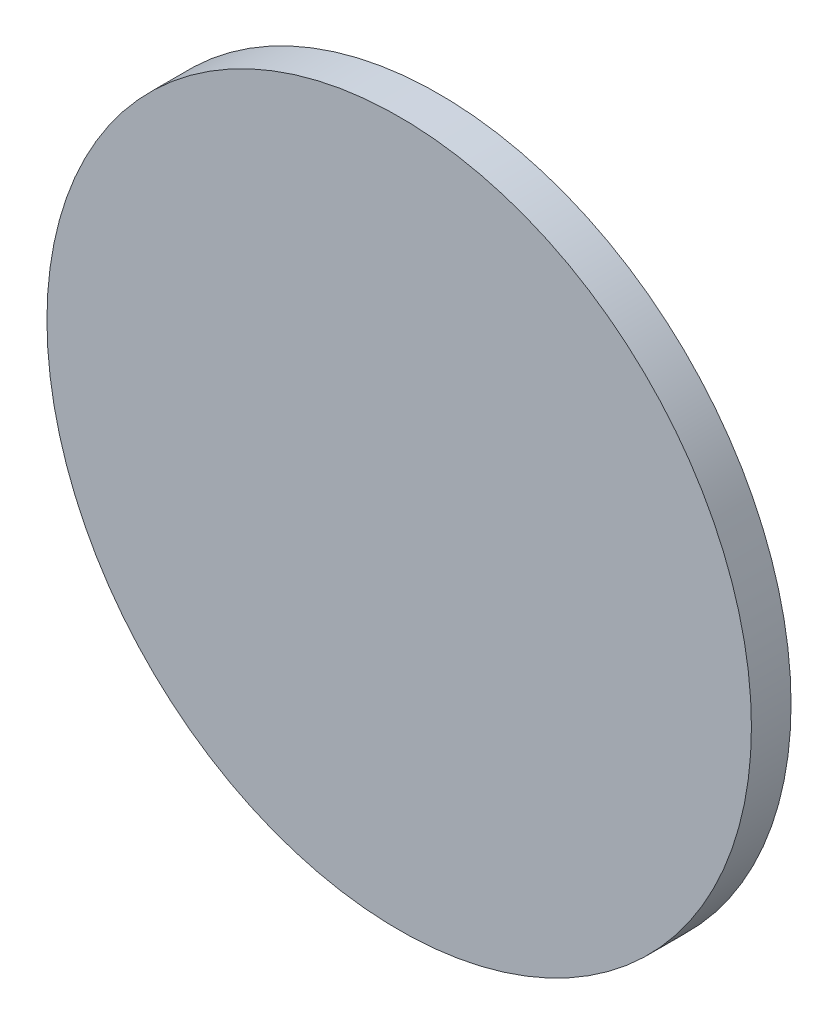
ISO-10303-21;
HEADER;
FILE_DESCRIPTION(('STEP AP214'),'2;1');
FILE_NAME('part.step','',(''),(''),'','','');
FILE_SCHEMA(('AUTOMOTIVE_DESIGN { 1 0 10303 214 1 1 1 1 }'));
ENDSEC;
DATA;
#1=APPLICATION_CONTEXT('core data for automotive mechanical design processes');
#2=APPLICATION_PROTOCOL_DEFINITION('international standard','automotive_design',2000,#1);
#3=PRODUCT_CONTEXT('',#1,'mechanical');
#4=PRODUCT('Part','Part','',(#3));
#5=PRODUCT_RELATED_PRODUCT_CATEGORY('part','',(#4));
#6=PRODUCT_DEFINITION_FORMATION('','',#4);
#7=PRODUCT_DEFINITION_CONTEXT('part definition',#1,'design');
#8=PRODUCT_DEFINITION('design','',#6,#7);
#9=PRODUCT_DEFINITION_SHAPE('','',#8);
#10=(LENGTH_UNIT() NAMED_UNIT(*) SI_UNIT(.MILLI.,.METRE.));
#11=(NAMED_UNIT(*) PLANE_ANGLE_UNIT() SI_UNIT($,.RADIAN.));
#12=(NAMED_UNIT(*) SI_UNIT($,.STERADIAN.) SOLID_ANGLE_UNIT());
#13=UNCERTAINTY_MEASURE_WITH_UNIT(LENGTH_MEASURE(1.E-05),#10,'distance_accuracy_value','');
#14=(GEOMETRIC_REPRESENTATION_CONTEXT(3) GLOBAL_UNCERTAINTY_ASSIGNED_CONTEXT((#13)) GLOBAL_UNIT_ASSIGNED_CONTEXT((#10,
#11,#12)) REPRESENTATION_CONTEXT('',''));
#15=CARTESIAN_POINT('',(0.,0.,0.));
#16=DIRECTION('',(0.,0.,1.));
#17=DIRECTION('',(1.,0.,0.));
#18=AXIS2_PLACEMENT_3D('',#15,#16,#17);
#19=CARTESIAN_POINT('',(10.44416,13.134908666667,0.782015));
#20=DIRECTION('',(0.,0.,1.));
#21=DIRECTION('',(1.,0.,0.));
#22=AXIS2_PLACEMENT_3D('',#19,#20,#21);
#23=PLANE('',#22);
#24=CARTESIAN_POINT('',(10.44416,13.134908666667,0.782015));
#25=DIRECTION('',(0.,0.,1.));
#26=DIRECTION('',(1.,0.,0.));
#27=AXIS2_PLACEMENT_3D('',#24,#25,#26);
#28=CIRCLE('',#27,0.1524);
#29=CARTESIAN_POINT('',(10.59656,13.134908666667,0.782015));
#30=VERTEX_POINT('',#29);
#31=EDGE_CURVE('E18',#30,#30,#28,.F.);
#32=ORIENTED_EDGE('',*,*,#31,.F.);
#33=EDGE_LOOP('',(#32));
#34=FACE_BOUND('',#33,.T.);
#35=ADVANCED_FACE('F15',(#34),#23,.T.);
#36=CARTESIAN_POINT('',(10.44416,13.134908666667,0.76487));
#37=DIRECTION('',(0.,0.,1.));
#38=DIRECTION('',(1.,0.,0.));
#39=AXIS2_PLACEMENT_3D('',#36,#37,#38);
#40=CYLINDRICAL_SURFACE('',#39,0.1524);
#41=ORIENTED_EDGE('',*,*,#31,.T.);
#42=EDGE_LOOP('',(#41));
#43=FACE_BOUND('',#42,.T.);
#44=CARTESIAN_POINT('',(10.44416,13.134908666667,0.76487));
#45=DIRECTION('',(0.,0.,1.));
#46=DIRECTION('',(1.,0.,0.));
#47=AXIS2_PLACEMENT_3D('',#44,#45,#46);
#48=CIRCLE('',#47,0.1524);
#49=CARTESIAN_POINT('',(10.59656,13.134908666667,0.76487));
#50=VERTEX_POINT('',#49);
#51=EDGE_CURVE('E10',#50,#50,#48,.F.);
#52=ORIENTED_EDGE('',*,*,#51,.F.);
#53=EDGE_LOOP('',(#52));
#54=FACE_BOUND('',#53,.T.);
#55=ADVANCED_FACE('F27',(#43,#54),#40,.T.);
#56=CARTESIAN_POINT('',(10.44416,13.134908666667,0.76487));
#57=DIRECTION('',(0.,0.,-1.));
#58=DIRECTION('',(-1.,0.,0.));
#59=AXIS2_PLACEMENT_3D('',#56,#57,#58);
#60=PLANE('',#59);
#61=ORIENTED_EDGE('',*,*,#51,.T.);
#62=EDGE_LOOP('',(#61));
#63=FACE_BOUND('',#62,.T.);
#64=ADVANCED_FACE('F35',(#63),#60,.T.);
#65=CLOSED_SHELL('',(#35,#55,#64));
#66=MANIFOLD_SOLID_BREP('B1',#65);
#67=ADVANCED_BREP_SHAPE_REPRESENTATION('',(#18,#66),#14);
#68=SHAPE_DEFINITION_REPRESENTATION(#9,#67);
ENDSEC;
END-ISO-10303-21;
